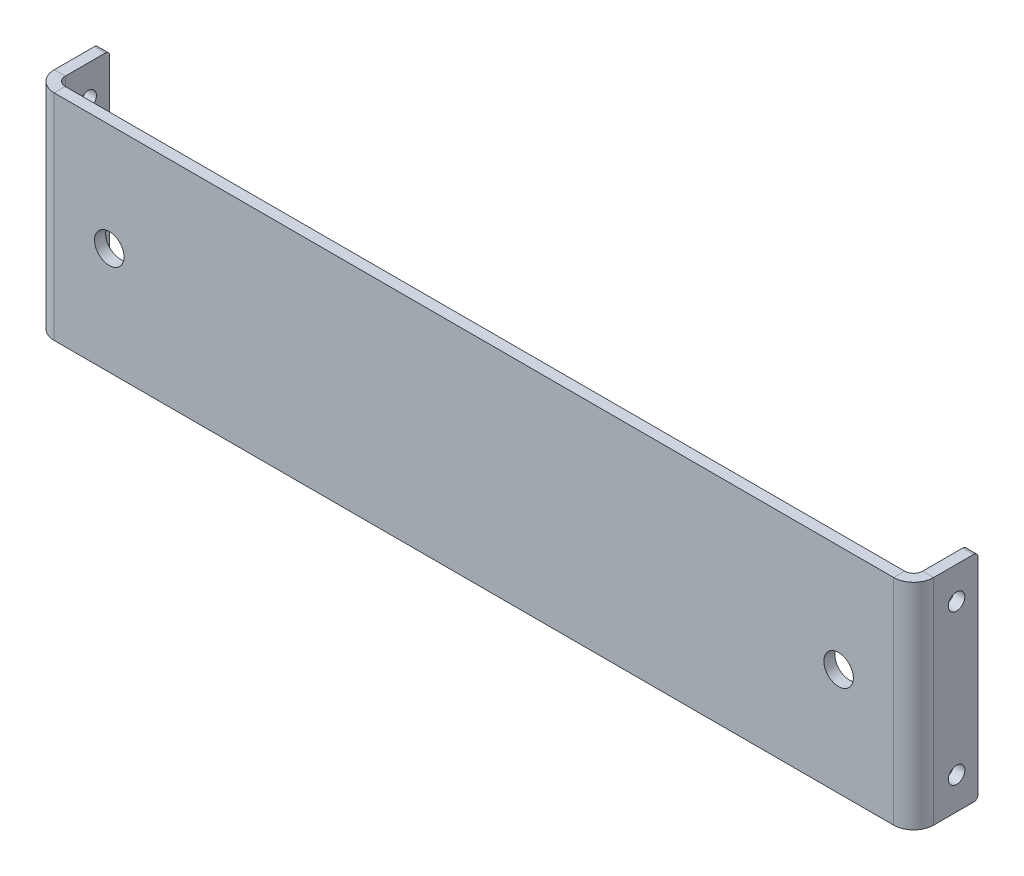
ISO-10303-21;
HEADER;
FILE_DESCRIPTION(('STEP AP214'),'2;1');
FILE_NAME('part.step','',(''),(''),'','','');
FILE_SCHEMA(('AUTOMOTIVE_DESIGN { 1 0 10303 214 1 1 1 1 }'));
ENDSEC;
DATA;
#1=APPLICATION_CONTEXT('core data for automotive mechanical design processes');
#2=APPLICATION_PROTOCOL_DEFINITION('international standard','automotive_design',2000,#1);
#3=PRODUCT_CONTEXT('',#1,'mechanical');
#4=PRODUCT('Part','Part','',(#3));
#5=PRODUCT_RELATED_PRODUCT_CATEGORY('part','',(#4));
#6=PRODUCT_DEFINITION_FORMATION('','',#4);
#7=PRODUCT_DEFINITION_CONTEXT('part definition',#1,'design');
#8=PRODUCT_DEFINITION('design','',#6,#7);
#9=PRODUCT_DEFINITION_SHAPE('','',#8);
#10=(LENGTH_UNIT() NAMED_UNIT(*) SI_UNIT(.MILLI.,.METRE.));
#11=(NAMED_UNIT(*) PLANE_ANGLE_UNIT() SI_UNIT($,.RADIAN.));
#12=(NAMED_UNIT(*) SI_UNIT($,.STERADIAN.) SOLID_ANGLE_UNIT());
#13=UNCERTAINTY_MEASURE_WITH_UNIT(LENGTH_MEASURE(1.E-05),#10,'distance_accuracy_value','');
#14=(GEOMETRIC_REPRESENTATION_CONTEXT(3) GLOBAL_UNCERTAINTY_ASSIGNED_CONTEXT((#13)) GLOBAL_UNIT_ASSIGNED_CONTEXT((#10,
#11,#12)) REPRESENTATION_CONTEXT('',''));
#15=CARTESIAN_POINT('',(0.,0.,0.));
#16=DIRECTION('',(0.,0.,1.));
#17=DIRECTION('',(1.,0.,0.));
#18=AXIS2_PLACEMENT_3D('',#15,#16,#17);
#19=CARTESIAN_POINT('',(0.,0.,-3.2639));
#20=DIRECTION('',(0.,0.,-1.));
#21=DIRECTION('',(-1.,0.,0.));
#22=AXIS2_PLACEMENT_3D('',#19,#20,#21);
#23=PLANE('',#22);
#24=CARTESIAN_POINT('',(-107.95,0.,-3.2639));
#25=DIRECTION('',(0.,0.,-1.));
#26=DIRECTION('',(-1.,0.,0.));
#27=AXIS2_PLACEMENT_3D('',#24,#25,#26);
#28=CIRCLE('',#27,4.365625);
#29=CARTESIAN_POINT('',(-112.315625,0.,-3.2639));
#30=VERTEX_POINT('',#29);
#31=EDGE_CURVE('E446',#30,#30,#28,.T.);
#32=ORIENTED_EDGE('',*,*,#31,.F.);
#33=EDGE_LOOP('',(#32));
#34=FACE_BOUND('',#33,.T.);
#35=CARTESIAN_POINT('',(107.95,0.,-3.2639));
#36=DIRECTION('',(0.,0.,-1.));
#37=DIRECTION('',(-1.,0.,0.));
#38=AXIS2_PLACEMENT_3D('',#35,#36,#37);
#39=CIRCLE('',#38,4.365625);
#40=CARTESIAN_POINT('',(103.584375,0.,-3.2639));
#41=VERTEX_POINT('',#40);
#42=EDGE_CURVE('E440',#41,#41,#39,.T.);
#43=ORIENTED_EDGE('',*,*,#42,.F.);
#44=EDGE_LOOP('',(#43));
#45=FACE_BOUND('',#44,.T.);
#46=DIRECTION('',(1.,0.,0.));
#47=VECTOR('',#46,1.);
#48=CARTESIAN_POINT('',(-130.175,-31.75,-3.2639));
#49=LINE('',#48,#47);
#50=CARTESIAN_POINT('',(-124.25426,-31.75,-3.26390000000002));
#51=VERTEX_POINT('',#50);
#52=CARTESIAN_POINT('',(124.25426,-31.75,-3.2639));
#53=VERTEX_POINT('',#52);
#54=EDGE_CURVE('E314',#51,#53,#49,.T.);
#55=ORIENTED_EDGE('',*,*,#54,.F.);
#56=DIRECTION('',(0.,1.,0.));
#57=VECTOR('',#56,1.);
#58=CARTESIAN_POINT('',(-124.25426,31.75,-3.26390000000002));
#59=LINE('',#58,#57);
#60=CARTESIAN_POINT('',(-124.25426,31.75,-3.26390000000002));
#61=VERTEX_POINT('',#60);
#62=EDGE_CURVE('E252',#61,#51,#59,.F.);
#63=ORIENTED_EDGE('',*,*,#62,.F.);
#64=DIRECTION('',(-1.,0.,0.));
#65=VECTOR('',#64,1.);
#66=CARTESIAN_POINT('',(-130.175,31.75,-3.2639));
#67=LINE('',#66,#65);
#68=CARTESIAN_POINT('',(124.25426,31.75,-3.2639));
#69=VERTEX_POINT('',#68);
#70=EDGE_CURVE('E311',#69,#61,#67,.T.);
#71=ORIENTED_EDGE('',*,*,#70,.F.);
#72=DIRECTION('',(0.,-1.,0.));
#73=VECTOR('',#72,1.);
#74=CARTESIAN_POINT('',(124.25426,-31.75,-3.26390000000002));
#75=LINE('',#74,#73);
#76=EDGE_CURVE('E301',#53,#69,#75,.F.);
#77=ORIENTED_EDGE('',*,*,#76,.F.);
#78=EDGE_LOOP('',(#55,#63,#71,#77));
#79=FACE_BOUND('',#78,.T.);
#80=ADVANCED_FACE('F81',(#34,#45,#79),#23,.T.);
#81=CARTESIAN_POINT('',(0.,0.,0.));
#82=DIRECTION('',(0.,0.,-1.));
#83=DIRECTION('',(-1.,0.,0.));
#84=AXIS2_PLACEMENT_3D('',#81,#82,#83);
#85=PLANE('',#84);
#86=CARTESIAN_POINT('',(-107.95,0.,0.));
#87=DIRECTION('',(0.,0.,1.));
#88=DIRECTION('',(1.,0.,0.));
#89=AXIS2_PLACEMENT_3D('',#86,#87,#88);
#90=CIRCLE('',#89,4.365625);
#91=CARTESIAN_POINT('',(-103.584375,0.,0.));
#92=VERTEX_POINT('',#91);
#93=EDGE_CURVE('E449',#92,#92,#90,.T.);
#94=ORIENTED_EDGE('',*,*,#93,.F.);
#95=EDGE_LOOP('',(#94));
#96=FACE_BOUND('',#95,.T.);
#97=CARTESIAN_POINT('',(107.95,0.,0.));
#98=DIRECTION('',(0.,0.,1.));
#99=DIRECTION('',(1.,0.,0.));
#100=AXIS2_PLACEMENT_3D('',#97,#98,#99);
#101=CIRCLE('',#100,4.365625);
#102=CARTESIAN_POINT('',(112.315625,0.,0.));
#103=VERTEX_POINT('',#102);
#104=EDGE_CURVE('E443',#103,#103,#101,.T.);
#105=ORIENTED_EDGE('',*,*,#104,.F.);
#106=EDGE_LOOP('',(#105));
#107=FACE_BOUND('',#106,.T.);
#108=DIRECTION('',(0.,1.,0.));
#109=VECTOR('',#108,1.);
#110=CARTESIAN_POINT('',(-124.25426,31.75,0.));
#111=LINE('',#110,#109);
#112=CARTESIAN_POINT('',(-124.25426,31.75,0.));
#113=VERTEX_POINT('',#112);
#114=CARTESIAN_POINT('',(-124.25426,-31.75,0.));
#115=VERTEX_POINT('',#114);
#116=EDGE_CURVE('E219',#113,#115,#111,.F.);
#117=ORIENTED_EDGE('',*,*,#116,.T.);
#118=DIRECTION('',(1.,0.,0.));
#119=VECTOR('',#118,1.);
#120=CARTESIAN_POINT('',(-130.175,-31.75,0.));
#121=LINE('',#120,#119);
#122=CARTESIAN_POINT('',(124.25426,-31.75,0.));
#123=VERTEX_POINT('',#122);
#124=EDGE_CURVE('E315',#115,#123,#121,.T.);
#125=ORIENTED_EDGE('',*,*,#124,.T.);
#126=DIRECTION('',(0.,-1.,0.));
#127=VECTOR('',#126,1.);
#128=CARTESIAN_POINT('',(124.25426,-31.75,0.));
#129=LINE('',#128,#127);
#130=CARTESIAN_POINT('',(124.25426,31.75,0.));
#131=VERTEX_POINT('',#130);
#132=EDGE_CURVE('E289',#123,#131,#129,.F.);
#133=ORIENTED_EDGE('',*,*,#132,.T.);
#134=DIRECTION('',(-1.,0.,0.));
#135=VECTOR('',#134,1.);
#136=CARTESIAN_POINT('',(-130.175,31.75,0.));
#137=LINE('',#136,#135);
#138=EDGE_CURVE('E309',#131,#113,#137,.T.);
#139=ORIENTED_EDGE('',*,*,#138,.T.);
#140=EDGE_LOOP('',(#117,#125,#133,#139));
#141=FACE_BOUND('',#140,.T.);
#142=ADVANCED_FACE('F396',(#96,#107,#141),#85,.F.);
#143=CARTESIAN_POINT('',(-130.175,31.75,-3.2639));
#144=DIRECTION('',(0.,1.,0.));
#145=DIRECTION('',(0.,0.,1.));
#146=AXIS2_PLACEMENT_3D('',#143,#144,#145);
#147=PLANE('',#146);
#148=ORIENTED_EDGE('',*,*,#70,.T.);
#149=DIRECTION('',(0.,0.,1.));
#150=VECTOR('',#149,1.);
#151=CARTESIAN_POINT('',(-124.25426,31.75,-3.26390000000002));
#152=LINE('',#151,#150);
#153=EDGE_CURVE('E248',#61,#113,#152,.T.);
#154=ORIENTED_EDGE('',*,*,#153,.T.);
#155=ORIENTED_EDGE('',*,*,#138,.F.);
#156=DIRECTION('',(0.,0.,1.));
#157=VECTOR('',#156,1.);
#158=CARTESIAN_POINT('',(124.25426,31.75,-3.26390000000002));
#159=LINE('',#158,#157);
#160=EDGE_CURVE('E306',#69,#131,#159,.T.);
#161=ORIENTED_EDGE('',*,*,#160,.F.);
#162=EDGE_LOOP('',(#148,#154,#155,#161));
#163=FACE_BOUND('',#162,.T.);
#164=ADVANCED_FACE('F399',(#163),#147,.T.);
#165=CARTESIAN_POINT('',(-130.175,-31.75,-3.2639));
#166=DIRECTION('',(0.,-1.,0.));
#167=DIRECTION('',(0.,0.,-1.));
#168=AXIS2_PLACEMENT_3D('',#165,#166,#167);
#169=PLANE('',#168);
#170=DIRECTION('',(0.,0.,1.));
#171=VECTOR('',#170,1.);
#172=CARTESIAN_POINT('',(-124.25426,-31.75,-3.26390000000002));
#173=LINE('',#172,#171);
#174=EDGE_CURVE('E256',#51,#115,#173,.T.);
#175=ORIENTED_EDGE('',*,*,#174,.F.);
#176=ORIENTED_EDGE('',*,*,#54,.T.);
#177=DIRECTION('',(0.,0.,1.));
#178=VECTOR('',#177,1.);
#179=CARTESIAN_POINT('',(124.25426,-31.75,-3.26390000000002));
#180=LINE('',#179,#178);
#181=EDGE_CURVE('E295',#53,#123,#180,.T.);
#182=ORIENTED_EDGE('',*,*,#181,.T.);
#183=ORIENTED_EDGE('',*,*,#124,.F.);
#184=EDGE_LOOP('',(#175,#176,#182,#183));
#185=FACE_BOUND('',#184,.T.);
#186=ADVANCED_FACE('F394',(#185),#169,.T.);
#187=CARTESIAN_POINT('',(124.25426,31.75,-5.92074000000002));
#188=DIRECTION('',(0.,1.,0.));
#189=DIRECTION('',(0.,0.,1.));
#190=AXIS2_PLACEMENT_3D('',#187,#188,#189);
#191=PLANE('',#190);
#192=DIRECTION('',(1.,0.,0.));
#193=VECTOR('',#192,1.);
#194=CARTESIAN_POINT('',(130.175,31.75,-5.92074));
#195=LINE('',#194,#193);
#196=CARTESIAN_POINT('',(126.9111,31.75,-5.92074000000001));
#197=VERTEX_POINT('',#196);
#198=CARTESIAN_POINT('',(130.175,31.75,-5.92074));
#199=VERTEX_POINT('',#198);
#200=EDGE_CURVE('E259',#197,#199,#195,.T.);
#201=ORIENTED_EDGE('',*,*,#200,.F.);
#202=CARTESIAN_POINT('',(124.25426,31.75,-5.92074000000002));
#203=DIRECTION('',(0.,-1.,0.));
#204=DIRECTION('',(0.,0.,-1.));
#205=AXIS2_PLACEMENT_3D('',#202,#203,#204);
#206=CIRCLE('',#205,2.65683999999999);
#207=EDGE_CURVE('E298',#69,#197,#206,.F.);
#208=ORIENTED_EDGE('',*,*,#207,.F.);
#209=ORIENTED_EDGE('',*,*,#160,.T.);
#210=CARTESIAN_POINT('',(124.25426,31.75,-5.92074000000002));
#211=DIRECTION('',(0.,-1.,0.));
#212=DIRECTION('',(0.,0.,-1.));
#213=AXIS2_PLACEMENT_3D('',#210,#211,#212);
#214=CIRCLE('',#213,5.92073999999999);
#215=EDGE_CURVE('E291',#131,#199,#214,.F.);
#216=ORIENTED_EDGE('',*,*,#215,.T.);
#217=EDGE_LOOP('',(#201,#208,#209,#216));
#218=FACE_BOUND('',#217,.T.);
#219=ADVANCED_FACE('F380',(#218),#191,.T.);
#220=CARTESIAN_POINT('',(124.25426,-31.75,-5.92074000000002));
#221=DIRECTION('',(0.,1.,0.));
#222=DIRECTION('',(0.,0.,1.));
#223=AXIS2_PLACEMENT_3D('',#220,#221,#222);
#224=PLANE('',#223);
#225=CARTESIAN_POINT('',(124.25426,-31.75,-5.92074000000002));
#226=DIRECTION('',(0.,-1.,0.));
#227=DIRECTION('',(0.,0.,-1.));
#228=AXIS2_PLACEMENT_3D('',#225,#226,#227);
#229=CIRCLE('',#228,2.65683999999999);
#230=CARTESIAN_POINT('',(126.9111,-31.75,-5.92074000000001));
#231=VERTEX_POINT('',#230);
#232=EDGE_CURVE('E264',#231,#53,#229,.T.);
#233=ORIENTED_EDGE('',*,*,#232,.F.);
#234=DIRECTION('',(1.,0.,0.));
#235=VECTOR('',#234,1.);
#236=CARTESIAN_POINT('',(126.9111,-31.75,-5.92074000000001));
#237=LINE('',#236,#235);
#238=CARTESIAN_POINT('',(130.175,-31.75,-5.92074));
#239=VERTEX_POINT('',#238);
#240=EDGE_CURVE('E281',#231,#239,#237,.T.);
#241=ORIENTED_EDGE('',*,*,#240,.T.);
#242=CARTESIAN_POINT('',(124.25426,-31.75,-5.92074000000002));
#243=DIRECTION('',(0.,-1.,0.));
#244=DIRECTION('',(0.,0.,-1.));
#245=AXIS2_PLACEMENT_3D('',#242,#243,#244);
#246=CIRCLE('',#245,5.92073999999999);
#247=EDGE_CURVE('E292',#239,#123,#246,.T.);
#248=ORIENTED_EDGE('',*,*,#247,.T.);
#249=ORIENTED_EDGE('',*,*,#181,.F.);
#250=EDGE_LOOP('',(#233,#241,#248,#249));
#251=FACE_BOUND('',#250,.T.);
#252=ADVANCED_FACE('F373',(#251),#224,.F.);
#253=CARTESIAN_POINT('',(124.25426,-31.75,-5.92074000000002));
#254=DIRECTION('',(0.,-1.,0.));
#255=DIRECTION('',(1.,0.,0.));
#256=AXIS2_PLACEMENT_3D('',#253,#254,#255);
#257=CYLINDRICAL_SURFACE('',#256,5.92073999999999);
#258=ORIENTED_EDGE('',*,*,#132,.F.);
#259=ORIENTED_EDGE('',*,*,#247,.F.);
#260=DIRECTION('',(0.,-1.,0.));
#261=VECTOR('',#260,1.);
#262=CARTESIAN_POINT('',(130.175,0.,-5.92074));
#263=LINE('',#262,#261);
#264=EDGE_CURVE('E278',#199,#239,#263,.T.);
#265=ORIENTED_EDGE('',*,*,#264,.F.);
#266=ORIENTED_EDGE('',*,*,#215,.F.);
#267=EDGE_LOOP('',(#258,#259,#265,#266));
#268=FACE_BOUND('',#267,.T.);
#269=ADVANCED_FACE('F378',(#268),#257,.T.);
#270=CARTESIAN_POINT('',(124.25426,-31.75,-5.92074000000002));
#271=DIRECTION('',(0.,-1.,0.));
#272=DIRECTION('',(1.,0.,0.));
#273=AXIS2_PLACEMENT_3D('',#270,#271,#272);
#274=CYLINDRICAL_SURFACE('',#273,2.65683999999999);
#275=ORIENTED_EDGE('',*,*,#76,.T.);
#276=ORIENTED_EDGE('',*,*,#207,.T.);
#277=DIRECTION('',(0.,1.,0.));
#278=VECTOR('',#277,1.);
#279=CARTESIAN_POINT('',(126.9111,31.75,-5.92074000000001));
#280=LINE('',#279,#278);
#281=EDGE_CURVE('E284',#197,#231,#280,.F.);
#282=ORIENTED_EDGE('',*,*,#281,.T.);
#283=ORIENTED_EDGE('',*,*,#232,.T.);
#284=EDGE_LOOP('',(#275,#276,#282,#283));
#285=FACE_BOUND('',#284,.T.);
#286=ADVANCED_FACE('F387',(#285),#274,.F.);
#287=CARTESIAN_POINT('',(130.175,-31.75,-3.26389999999999));
#288=DIRECTION('',(0.,-1.,0.));
#289=DIRECTION('',(0.,0.,-1.));
#290=AXIS2_PLACEMENT_3D('',#287,#288,#289);
#291=PLANE('',#290);
#292=DIRECTION('',(0.,0.,-1.));
#293=VECTOR('',#292,1.);
#294=CARTESIAN_POINT('',(126.9111,-31.75,4.57754867353493E-13));
#295=LINE('',#294,#293);
#296=CARTESIAN_POINT('',(126.9111,-31.75,-17.78));
#297=VERTEX_POINT('',#296);
#298=EDGE_CURVE('E270',#297,#231,#295,.F.);
#299=ORIENTED_EDGE('',*,*,#298,.F.);
#300=DIRECTION('',(-1.,0.,0.));
#301=VECTOR('',#300,1.);
#302=CARTESIAN_POINT('',(130.175,-31.75,-17.78));
#303=LINE('',#302,#301);
#304=CARTESIAN_POINT('',(130.175,-31.75,-17.78));
#305=VERTEX_POINT('',#304);
#306=EDGE_CURVE('E104',#297,#305,#303,.F.);
#307=ORIENTED_EDGE('',*,*,#306,.T.);
#308=DIRECTION('',(0.,0.,1.));
#309=VECTOR('',#308,1.);
#310=CARTESIAN_POINT('',(130.175,-31.75,-3.26389999999999));
#311=LINE('',#310,#309);
#312=EDGE_CURVE('E262',#305,#239,#311,.T.);
#313=ORIENTED_EDGE('',*,*,#312,.T.);
#314=ORIENTED_EDGE('',*,*,#240,.F.);
#315=EDGE_LOOP('',(#299,#307,#313,#314));
#316=FACE_BOUND('',#315,.T.);
#317=ADVANCED_FACE('F369',(#316),#291,.T.);
#318=CARTESIAN_POINT('',(130.175,31.75,-19.05));
#319=DIRECTION('',(0.,1.,0.));
#320=DIRECTION('',(0.,0.,1.));
#321=AXIS2_PLACEMENT_3D('',#318,#319,#320);
#322=PLANE('',#321);
#323=DIRECTION('',(0.,0.,-1.));
#324=VECTOR('',#323,1.);
#325=CARTESIAN_POINT('',(130.175,31.75,-19.05));
#326=LINE('',#325,#324);
#327=CARTESIAN_POINT('',(130.175,31.75,-17.78));
#328=VERTEX_POINT('',#327);
#329=EDGE_CURVE('E268',#199,#328,#326,.T.);
#330=ORIENTED_EDGE('',*,*,#329,.T.);
#331=DIRECTION('',(-1.,0.,0.));
#332=VECTOR('',#331,1.);
#333=CARTESIAN_POINT('',(130.175,31.75,-17.78));
#334=LINE('',#333,#332);
#335=CARTESIAN_POINT('',(126.9111,31.75,-17.78));
#336=VERTEX_POINT('',#335);
#337=EDGE_CURVE('E13',#328,#336,#334,.T.);
#338=ORIENTED_EDGE('',*,*,#337,.T.);
#339=DIRECTION('',(0.,0.,1.));
#340=VECTOR('',#339,1.);
#341=CARTESIAN_POINT('',(126.9111,31.75,4.43798926275643E-13));
#342=LINE('',#341,#340);
#343=EDGE_CURVE('E275',#197,#336,#342,.F.);
#344=ORIENTED_EDGE('',*,*,#343,.F.);
#345=ORIENTED_EDGE('',*,*,#200,.T.);
#346=EDGE_LOOP('',(#330,#338,#344,#345));
#347=FACE_BOUND('',#346,.T.);
#348=ADVANCED_FACE('F384',(#347),#322,.T.);
#349=CARTESIAN_POINT('',(130.175,0.,4.69150713295343E-13));
#350=DIRECTION('',(1.,0.,0.));
#351=DIRECTION('',(0.,0.,-1.));
#352=AXIS2_PLACEMENT_3D('',#349,#350,#351);
#353=PLANE('',#352);
#354=CARTESIAN_POINT('',(130.175,22.225,-12.7));
#355=DIRECTION('',(1.,0.,0.));
#356=DIRECTION('',(0.,0.,-1.));
#357=AXIS2_PLACEMENT_3D('',#354,#355,#356);
#358=CIRCLE('',#357,2.45745);
#359=CARTESIAN_POINT('',(130.175,22.225,-15.15745));
#360=VERTEX_POINT('',#359);
#361=EDGE_CURVE('E437',#360,#360,#358,.T.);
#362=ORIENTED_EDGE('',*,*,#361,.F.);
#363=EDGE_LOOP('',(#362));
#364=FACE_BOUND('',#363,.T.);
#365=CARTESIAN_POINT('',(130.175,-22.225,-12.7));
#366=DIRECTION('',(1.,0.,0.));
#367=DIRECTION('',(0.,0.,-1.));
#368=AXIS2_PLACEMENT_3D('',#365,#366,#367);
#369=CIRCLE('',#368,2.45745);
#370=CARTESIAN_POINT('',(130.175,-22.225,-15.15745));
#371=VERTEX_POINT('',#370);
#372=EDGE_CURVE('E430',#371,#371,#369,.T.);
#373=ORIENTED_EDGE('',*,*,#372,.F.);
#374=EDGE_LOOP('',(#373));
#375=FACE_BOUND('',#374,.T.);
#376=ORIENTED_EDGE('',*,*,#312,.F.);
#377=CARTESIAN_POINT('',(130.175,-30.48,-17.78));
#378=DIRECTION('',(1.,0.,0.));
#379=DIRECTION('',(0.,0.,-1.));
#380=AXIS2_PLACEMENT_3D('',#377,#378,#379);
#381=CIRCLE('',#380,1.27);
#382=CARTESIAN_POINT('',(130.175,-30.48,-19.05));
#383=VERTEX_POINT('',#382);
#384=EDGE_CURVE('E89',#305,#383,#381,.T.);
#385=ORIENTED_EDGE('',*,*,#384,.T.);
#386=DIRECTION('',(0.,-1.,0.));
#387=VECTOR('',#386,1.);
#388=CARTESIAN_POINT('',(130.175,-31.75,-19.05));
#389=LINE('',#388,#387);
#390=CARTESIAN_POINT('',(130.175,30.48,-19.05));
#391=VERTEX_POINT('',#390);
#392=EDGE_CURVE('E265',#391,#383,#389,.T.);
#393=ORIENTED_EDGE('',*,*,#392,.F.);
#394=CARTESIAN_POINT('',(130.175,30.48,-17.78));
#395=DIRECTION('',(1.,0.,0.));
#396=DIRECTION('',(0.,0.,-1.));
#397=AXIS2_PLACEMENT_3D('',#394,#395,#396);
#398=CIRCLE('',#397,1.27);
#399=EDGE_CURVE('E96',#391,#328,#398,.T.);
#400=ORIENTED_EDGE('',*,*,#399,.T.);
#401=ORIENTED_EDGE('',*,*,#329,.F.);
#402=ORIENTED_EDGE('',*,*,#264,.T.);
#403=EDGE_LOOP('',(#376,#385,#393,#400,#401,#402));
#404=FACE_BOUND('',#403,.T.);
#405=ADVANCED_FACE('F357',(#364,#375,#404),#353,.T.);
#406=CARTESIAN_POINT('',(126.9111,0.,4.57754867353493E-13));
#407=DIRECTION('',(1.,0.,0.));
#408=DIRECTION('',(0.,0.,-1.));
#409=AXIS2_PLACEMENT_3D('',#406,#407,#408);
#410=PLANE('',#409);
#411=CARTESIAN_POINT('',(126.9111,22.225,-12.7));
#412=DIRECTION('',(1.,0.,0.));
#413=DIRECTION('',(0.,0.,-1.));
#414=AXIS2_PLACEMENT_3D('',#411,#412,#413);
#415=CIRCLE('',#414,2.45744999999998);
#416=CARTESIAN_POINT('',(126.9111,22.225,-15.15745));
#417=VERTEX_POINT('',#416);
#418=EDGE_CURVE('E328',#417,#417,#415,.T.);
#419=ORIENTED_EDGE('',*,*,#418,.T.);
#420=EDGE_LOOP('',(#419));
#421=FACE_BOUND('',#420,.T.);
#422=CARTESIAN_POINT('',(126.9111,-22.225,-12.7));
#423=DIRECTION('',(1.,0.,0.));
#424=DIRECTION('',(0.,0.,-1.));
#425=AXIS2_PLACEMENT_3D('',#422,#423,#424);
#426=CIRCLE('',#425,2.45744999999998);
#427=CARTESIAN_POINT('',(126.9111,-22.225,-15.15745));
#428=VERTEX_POINT('',#427);
#429=EDGE_CURVE('E245',#428,#428,#426,.T.);
#430=ORIENTED_EDGE('',*,*,#429,.T.);
#431=EDGE_LOOP('',(#430));
#432=FACE_BOUND('',#431,.T.);
#433=DIRECTION('',(0.,1.,0.));
#434=VECTOR('',#433,1.);
#435=CARTESIAN_POINT('',(126.9111,0.,-19.05));
#436=LINE('',#435,#434);
#437=CARTESIAN_POINT('',(126.9111,30.48,-19.05));
#438=VERTEX_POINT('',#437);
#439=CARTESIAN_POINT('',(126.9111,-30.48,-19.05));
#440=VERTEX_POINT('',#439);
#441=EDGE_CURVE('E272',#438,#440,#436,.F.);
#442=ORIENTED_EDGE('',*,*,#441,.T.);
#443=CARTESIAN_POINT('',(126.9111,-30.48,-17.78));
#444=DIRECTION('',(1.,0.,0.));
#445=DIRECTION('',(0.,0.,-1.));
#446=AXIS2_PLACEMENT_3D('',#443,#444,#445);
#447=CIRCLE('',#446,1.27);
#448=EDGE_CURVE('E353',#440,#297,#447,.F.);
#449=ORIENTED_EDGE('',*,*,#448,.T.);
#450=ORIENTED_EDGE('',*,*,#298,.T.);
#451=ORIENTED_EDGE('',*,*,#281,.F.);
#452=ORIENTED_EDGE('',*,*,#343,.T.);
#453=CARTESIAN_POINT('',(126.9111,30.48,-17.78));
#454=DIRECTION('',(1.,0.,0.));
#455=DIRECTION('',(0.,0.,-1.));
#456=AXIS2_PLACEMENT_3D('',#453,#454,#455);
#457=CIRCLE('',#456,1.27);
#458=EDGE_CURVE('E351',#336,#438,#457,.F.);
#459=ORIENTED_EDGE('',*,*,#458,.T.);
#460=EDGE_LOOP('',(#442,#449,#450,#451,#452,#459));
#461=FACE_BOUND('',#460,.T.);
#462=ADVANCED_FACE('F366',(#421,#432,#461),#410,.F.);
#463=CARTESIAN_POINT('',(130.175,-31.75,-19.05));
#464=DIRECTION('',(0.,0.,-1.));
#465=DIRECTION('',(-1.,0.,0.));
#466=AXIS2_PLACEMENT_3D('',#463,#464,#465);
#467=PLANE('',#466);
#468=ORIENTED_EDGE('',*,*,#392,.T.);
#469=DIRECTION('',(-1.,0.,0.));
#470=VECTOR('',#469,1.);
#471=CARTESIAN_POINT('',(130.175,-30.48,-19.05));
#472=LINE('',#471,#470);
#473=EDGE_CURVE('E348',#383,#440,#472,.T.);
#474=ORIENTED_EDGE('',*,*,#473,.T.);
#475=ORIENTED_EDGE('',*,*,#441,.F.);
#476=DIRECTION('',(-1.,0.,0.));
#477=VECTOR('',#476,1.);
#478=CARTESIAN_POINT('',(130.175,30.48,-19.05));
#479=LINE('',#478,#477);
#480=EDGE_CURVE('E346',#438,#391,#479,.F.);
#481=ORIENTED_EDGE('',*,*,#480,.T.);
#482=EDGE_LOOP('',(#468,#474,#475,#481));
#483=FACE_BOUND('',#482,.T.);
#484=ADVANCED_FACE('F361',(#483),#467,.T.);
#485=CARTESIAN_POINT('',(-124.25426,-31.75,-5.92074000000002));
#486=DIRECTION('',(0.,-1.,0.));
#487=DIRECTION('',(0.,0.,-1.));
#488=AXIS2_PLACEMENT_3D('',#485,#486,#487);
#489=PLANE('',#488);
#490=DIRECTION('',(-1.,0.,0.));
#491=VECTOR('',#490,1.);
#492=CARTESIAN_POINT('',(-130.175,-31.75,-5.92074));
#493=LINE('',#492,#491);
#494=CARTESIAN_POINT('',(-126.9111,-31.75,-5.92074000000001));
#495=VERTEX_POINT('',#494);
#496=CARTESIAN_POINT('',(-130.175,-31.75,-5.92074));
#497=VERTEX_POINT('',#496);
#498=EDGE_CURVE('E242',#495,#497,#493,.T.);
#499=ORIENTED_EDGE('',*,*,#498,.F.);
#500=CARTESIAN_POINT('',(-124.25426,-31.75,-5.92074000000002));
#501=DIRECTION('',(0.,1.,0.));
#502=DIRECTION('',(0.,0.,1.));
#503=AXIS2_PLACEMENT_3D('',#500,#501,#502);
#504=CIRCLE('',#503,2.65683999999999);
#505=EDGE_CURVE('E222',#51,#495,#504,.F.);
#506=ORIENTED_EDGE('',*,*,#505,.F.);
#507=ORIENTED_EDGE('',*,*,#174,.T.);
#508=CARTESIAN_POINT('',(-124.25426,-31.75,-5.92074000000002));
#509=DIRECTION('',(0.,1.,0.));
#510=DIRECTION('',(0.,0.,1.));
#511=AXIS2_PLACEMENT_3D('',#508,#509,#510);
#512=CIRCLE('',#511,5.92073999999999);
#513=EDGE_CURVE('E247',#115,#497,#512,.F.);
#514=ORIENTED_EDGE('',*,*,#513,.T.);
#515=EDGE_LOOP('',(#499,#506,#507,#514));
#516=FACE_BOUND('',#515,.T.);
#517=ADVANCED_FACE('F560',(#516),#489,.T.);
#518=CARTESIAN_POINT('',(-124.25426,31.75,-5.92074000000002));
#519=DIRECTION('',(0.,-1.,0.));
#520=DIRECTION('',(0.,0.,-1.));
#521=AXIS2_PLACEMENT_3D('',#518,#519,#520);
#522=PLANE('',#521);
#523=CARTESIAN_POINT('',(-124.25426,31.75,-5.92074000000002));
#524=DIRECTION('',(0.,1.,0.));
#525=DIRECTION('',(0.,0.,1.));
#526=AXIS2_PLACEMENT_3D('',#523,#524,#525);
#527=CIRCLE('',#526,2.65683999999999);
#528=CARTESIAN_POINT('',(-126.9111,31.75,-5.92074000000001));
#529=VERTEX_POINT('',#528);
#530=EDGE_CURVE('E208',#529,#61,#527,.T.);
#531=ORIENTED_EDGE('',*,*,#530,.F.);
#532=DIRECTION('',(-1.,0.,0.));
#533=VECTOR('',#532,1.);
#534=CARTESIAN_POINT('',(-126.9111,31.75,-5.92074000000001));
#535=LINE('',#534,#533);
#536=CARTESIAN_POINT('',(-130.175,31.75,-5.92074));
#537=VERTEX_POINT('',#536);
#538=EDGE_CURVE('E202',#529,#537,#535,.T.);
#539=ORIENTED_EDGE('',*,*,#538,.T.);
#540=CARTESIAN_POINT('',(-124.25426,31.75,-5.92074000000002));
#541=DIRECTION('',(0.,1.,0.));
#542=DIRECTION('',(0.,0.,1.));
#543=AXIS2_PLACEMENT_3D('',#540,#541,#542);
#544=CIRCLE('',#543,5.92073999999999);
#545=EDGE_CURVE('E214',#537,#113,#544,.T.);
#546=ORIENTED_EDGE('',*,*,#545,.T.);
#547=ORIENTED_EDGE('',*,*,#153,.F.);
#548=EDGE_LOOP('',(#531,#539,#546,#547));
#549=FACE_BOUND('',#548,.T.);
#550=ADVANCED_FACE('F225',(#549),#522,.F.);
#551=CARTESIAN_POINT('',(-124.25426,31.75,-5.92074000000002));
#552=DIRECTION('',(0.,1.,0.));
#553=DIRECTION('',(-1.,0.,0.));
#554=AXIS2_PLACEMENT_3D('',#551,#552,#553);
#555=CYLINDRICAL_SURFACE('',#554,5.92073999999999);
#556=ORIENTED_EDGE('',*,*,#116,.F.);
#557=ORIENTED_EDGE('',*,*,#545,.F.);
#558=DIRECTION('',(0.,1.,0.));
#559=VECTOR('',#558,1.);
#560=CARTESIAN_POINT('',(-130.175,-31.75,-5.92074));
#561=LINE('',#560,#559);
#562=EDGE_CURVE('E217',#537,#497,#561,.F.);
#563=ORIENTED_EDGE('',*,*,#562,.T.);
#564=ORIENTED_EDGE('',*,*,#513,.F.);
#565=EDGE_LOOP('',(#556,#557,#563,#564));
#566=FACE_BOUND('',#565,.T.);
#567=ADVANCED_FACE('F215',(#566),#555,.T.);
#568=CARTESIAN_POINT('',(-124.25426,31.75,-5.92074000000002));
#569=DIRECTION('',(0.,1.,0.));
#570=DIRECTION('',(-1.,0.,0.));
#571=AXIS2_PLACEMENT_3D('',#568,#569,#570);
#572=CYLINDRICAL_SURFACE('',#571,2.65683999999999);
#573=ORIENTED_EDGE('',*,*,#62,.T.);
#574=ORIENTED_EDGE('',*,*,#505,.T.);
#575=DIRECTION('',(0.,1.,0.));
#576=VECTOR('',#575,1.);
#577=CARTESIAN_POINT('',(-126.9111,-31.75,-5.92074000000001));
#578=LINE('',#577,#576);
#579=EDGE_CURVE('E227',#495,#529,#578,.T.);
#580=ORIENTED_EDGE('',*,*,#579,.T.);
#581=ORIENTED_EDGE('',*,*,#530,.T.);
#582=EDGE_LOOP('',(#573,#574,#580,#581));
#583=FACE_BOUND('',#582,.T.);
#584=ADVANCED_FACE('F401',(#583),#572,.F.);
#585=CARTESIAN_POINT('',(-130.175,-31.75,-3.26389999999999));
#586=DIRECTION('',(0.,-1.,0.));
#587=DIRECTION('',(0.,0.,-1.));
#588=AXIS2_PLACEMENT_3D('',#585,#586,#587);
#589=PLANE('',#588);
#590=DIRECTION('',(0.,0.,1.));
#591=VECTOR('',#590,1.);
#592=CARTESIAN_POINT('',(-130.175,-31.75,-3.26389999999999));
#593=LINE('',#592,#591);
#594=CARTESIAN_POINT('',(-130.175,-31.75,-17.78));
#595=VERTEX_POINT('',#594);
#596=EDGE_CURVE('E232',#497,#595,#593,.F.);
#597=ORIENTED_EDGE('',*,*,#596,.T.);
#598=DIRECTION('',(1.,0.,0.));
#599=VECTOR('',#598,1.);
#600=CARTESIAN_POINT('',(-130.175,-31.75,-17.78));
#601=LINE('',#600,#599);
#602=CARTESIAN_POINT('',(-126.9111,-31.75,-17.78));
#603=VERTEX_POINT('',#602);
#604=EDGE_CURVE('E343',#595,#603,#601,.T.);
#605=ORIENTED_EDGE('',*,*,#604,.T.);
#606=DIRECTION('',(0.,0.,-1.));
#607=VECTOR('',#606,1.);
#608=CARTESIAN_POINT('',(-126.9111,-31.75,4.57754867353493E-13));
#609=LINE('',#608,#607);
#610=EDGE_CURVE('E233',#495,#603,#609,.T.);
#611=ORIENTED_EDGE('',*,*,#610,.F.);
#612=ORIENTED_EDGE('',*,*,#498,.T.);
#613=EDGE_LOOP('',(#597,#605,#611,#612));
#614=FACE_BOUND('',#613,.T.);
#615=ADVANCED_FACE('F410',(#614),#589,.T.);
#616=CARTESIAN_POINT('',(-130.175,31.75,-19.05));
#617=DIRECTION('',(0.,1.,0.));
#618=DIRECTION('',(0.,0.,1.));
#619=AXIS2_PLACEMENT_3D('',#616,#617,#618);
#620=PLANE('',#619);
#621=DIRECTION('',(0.,0.,1.));
#622=VECTOR('',#621,1.);
#623=CARTESIAN_POINT('',(-126.9111,31.75,4.43798926275643E-13));
#624=LINE('',#623,#622);
#625=CARTESIAN_POINT('',(-126.9111,31.75,-17.78));
#626=VERTEX_POINT('',#625);
#627=EDGE_CURVE('E408',#626,#529,#624,.T.);
#628=ORIENTED_EDGE('',*,*,#627,.F.);
#629=DIRECTION('',(1.,0.,0.));
#630=VECTOR('',#629,1.);
#631=CARTESIAN_POINT('',(-130.175,31.75,-17.78));
#632=LINE('',#631,#630);
#633=CARTESIAN_POINT('',(-130.175,31.75,-17.78));
#634=VERTEX_POINT('',#633);
#635=EDGE_CURVE('E204',#626,#634,#632,.F.);
#636=ORIENTED_EDGE('',*,*,#635,.T.);
#637=DIRECTION('',(0.,0.,-1.));
#638=VECTOR('',#637,1.);
#639=CARTESIAN_POINT('',(-130.175,31.75,-19.05));
#640=LINE('',#639,#638);
#641=EDGE_CURVE('E197',#634,#537,#640,.F.);
#642=ORIENTED_EDGE('',*,*,#641,.T.);
#643=ORIENTED_EDGE('',*,*,#538,.F.);
#644=EDGE_LOOP('',(#628,#636,#642,#643));
#645=FACE_BOUND('',#644,.T.);
#646=ADVANCED_FACE('F200',(#645),#620,.T.);
#647=CARTESIAN_POINT('',(-130.175,0.,4.69150713295344E-13));
#648=DIRECTION('',(1.,0.,0.));
#649=DIRECTION('',(0.,0.,-1.));
#650=AXIS2_PLACEMENT_3D('',#647,#648,#649);
#651=PLANE('',#650);
#652=CARTESIAN_POINT('',(-130.175,22.225,-12.7000000000009));
#653=DIRECTION('',(1.,0.,0.));
#654=DIRECTION('',(0.,0.,-1.));
#655=AXIS2_PLACEMENT_3D('',#652,#653,#654);
#656=CIRCLE('',#655,2.45744999999997);
#657=CARTESIAN_POINT('',(-130.175,22.225,-15.1574500000009));
#658=VERTEX_POINT('',#657);
#659=EDGE_CURVE('E329',#658,#658,#656,.T.);
#660=ORIENTED_EDGE('',*,*,#659,.T.);
#661=EDGE_LOOP('',(#660));
#662=FACE_BOUND('',#661,.T.);
#663=CARTESIAN_POINT('',(-130.175,-22.225,-12.7000000000009));
#664=DIRECTION('',(1.,0.,0.));
#665=DIRECTION('',(0.,0.,-1.));
#666=AXIS2_PLACEMENT_3D('',#663,#664,#665);
#667=CIRCLE('',#666,2.45744999999997);
#668=CARTESIAN_POINT('',(-130.175,-22.225,-15.1574500000009));
#669=VERTEX_POINT('',#668);
#670=EDGE_CURVE('E324',#669,#669,#667,.T.);
#671=ORIENTED_EDGE('',*,*,#670,.T.);
#672=EDGE_LOOP('',(#671));
#673=FACE_BOUND('',#672,.T.);
#674=ORIENTED_EDGE('',*,*,#641,.F.);
#675=CARTESIAN_POINT('',(-130.175,30.48,-17.78));
#676=DIRECTION('',(1.,0.,0.));
#677=DIRECTION('',(0.,0.,-1.));
#678=AXIS2_PLACEMENT_3D('',#675,#676,#677);
#679=CIRCLE('',#678,1.27);
#680=CARTESIAN_POINT('',(-130.175,30.48,-19.05));
#681=VERTEX_POINT('',#680);
#682=EDGE_CURVE('E341',#634,#681,#679,.F.);
#683=ORIENTED_EDGE('',*,*,#682,.T.);
#684=DIRECTION('',(0.,-1.,0.));
#685=VECTOR('',#684,1.);
#686=CARTESIAN_POINT('',(-130.175,-31.75,-19.05));
#687=LINE('',#686,#685);
#688=CARTESIAN_POINT('',(-130.175,-30.48,-19.05));
#689=VERTEX_POINT('',#688);
#690=EDGE_CURVE('E209',#689,#681,#687,.F.);
#691=ORIENTED_EDGE('',*,*,#690,.F.);
#692=CARTESIAN_POINT('',(-130.175,-30.48,-17.78));
#693=DIRECTION('',(1.,0.,0.));
#694=DIRECTION('',(0.,0.,-1.));
#695=AXIS2_PLACEMENT_3D('',#692,#693,#694);
#696=CIRCLE('',#695,1.27);
#697=EDGE_CURVE('E339',#689,#595,#696,.F.);
#698=ORIENTED_EDGE('',*,*,#697,.T.);
#699=ORIENTED_EDGE('',*,*,#596,.F.);
#700=ORIENTED_EDGE('',*,*,#562,.F.);
#701=EDGE_LOOP('',(#674,#683,#691,#698,#699,#700));
#702=FACE_BOUND('',#701,.T.);
#703=ADVANCED_FACE('F230',(#662,#673,#702),#651,.F.);
#704=CARTESIAN_POINT('',(-126.9111,0.,4.57754867353493E-13));
#705=DIRECTION('',(1.,0.,0.));
#706=DIRECTION('',(0.,0.,-1.));
#707=AXIS2_PLACEMENT_3D('',#704,#705,#706);
#708=PLANE('',#707);
#709=CARTESIAN_POINT('',(-126.9111,22.225,-12.7000000000009));
#710=DIRECTION('',(1.,0.,0.));
#711=DIRECTION('',(0.,0.,-1.));
#712=AXIS2_PLACEMENT_3D('',#709,#710,#711);
#713=CIRCLE('',#712,2.45744999999998);
#714=CARTESIAN_POINT('',(-126.9111,22.225,-15.1574500000009));
#715=VERTEX_POINT('',#714);
#716=EDGE_CURVE('E325',#715,#715,#713,.T.);
#717=ORIENTED_EDGE('',*,*,#716,.F.);
#718=EDGE_LOOP('',(#717));
#719=FACE_BOUND('',#718,.T.);
#720=CARTESIAN_POINT('',(-126.9111,-22.225,-12.7000000000009));
#721=DIRECTION('',(1.,0.,0.));
#722=DIRECTION('',(0.,0.,-1.));
#723=AXIS2_PLACEMENT_3D('',#720,#721,#722);
#724=CIRCLE('',#723,2.45744999999998);
#725=CARTESIAN_POINT('',(-126.9111,-22.225,-15.1574500000009));
#726=VERTEX_POINT('',#725);
#727=EDGE_CURVE('E321',#726,#726,#724,.T.);
#728=ORIENTED_EDGE('',*,*,#727,.F.);
#729=EDGE_LOOP('',(#728));
#730=FACE_BOUND('',#729,.T.);
#731=DIRECTION('',(0.,1.,0.));
#732=VECTOR('',#731,1.);
#733=CARTESIAN_POINT('',(-126.9111,0.,-19.05));
#734=LINE('',#733,#732);
#735=CARTESIAN_POINT('',(-126.9111,-30.48,-19.05));
#736=VERTEX_POINT('',#735);
#737=CARTESIAN_POINT('',(-126.9111,30.48,-19.05));
#738=VERTEX_POINT('',#737);
#739=EDGE_CURVE('E236',#736,#738,#734,.T.);
#740=ORIENTED_EDGE('',*,*,#739,.T.);
#741=CARTESIAN_POINT('',(-126.9111,30.48,-17.78));
#742=DIRECTION('',(1.,0.,0.));
#743=DIRECTION('',(0.,0.,-1.));
#744=AXIS2_PLACEMENT_3D('',#741,#742,#743);
#745=CIRCLE('',#744,1.27);
#746=EDGE_CURVE('E336',#738,#626,#745,.T.);
#747=ORIENTED_EDGE('',*,*,#746,.T.);
#748=ORIENTED_EDGE('',*,*,#627,.T.);
#749=ORIENTED_EDGE('',*,*,#579,.F.);
#750=ORIENTED_EDGE('',*,*,#610,.T.);
#751=CARTESIAN_POINT('',(-126.9111,-30.48,-17.78));
#752=DIRECTION('',(1.,0.,0.));
#753=DIRECTION('',(0.,0.,-1.));
#754=AXIS2_PLACEMENT_3D('',#751,#752,#753);
#755=CIRCLE('',#754,1.27);
#756=EDGE_CURVE('E334',#603,#736,#755,.T.);
#757=ORIENTED_EDGE('',*,*,#756,.T.);
#758=EDGE_LOOP('',(#740,#747,#748,#749,#750,#757));
#759=FACE_BOUND('',#758,.T.);
#760=ADVANCED_FACE('F407',(#719,#730,#759),#708,.T.);
#761=CARTESIAN_POINT('',(-130.175,-31.75,-19.05));
#762=DIRECTION('',(0.,0.,-1.));
#763=DIRECTION('',(-1.,0.,0.));
#764=AXIS2_PLACEMENT_3D('',#761,#762,#763);
#765=PLANE('',#764);
#766=ORIENTED_EDGE('',*,*,#690,.T.);
#767=DIRECTION('',(1.,0.,0.));
#768=VECTOR('',#767,1.);
#769=CARTESIAN_POINT('',(-130.175,30.48,-19.05));
#770=LINE('',#769,#768);
#771=EDGE_CURVE('E331',#681,#738,#770,.T.);
#772=ORIENTED_EDGE('',*,*,#771,.T.);
#773=ORIENTED_EDGE('',*,*,#739,.F.);
#774=DIRECTION('',(1.,0.,0.));
#775=VECTOR('',#774,1.);
#776=CARTESIAN_POINT('',(-130.175,-30.48,-19.05));
#777=LINE('',#776,#775);
#778=EDGE_CURVE('E317',#736,#689,#777,.F.);
#779=ORIENTED_EDGE('',*,*,#778,.T.);
#780=EDGE_LOOP('',(#766,#772,#773,#779));
#781=FACE_BOUND('',#780,.T.);
#782=ADVANCED_FACE('F419',(#781),#765,.T.);
#783=CARTESIAN_POINT('',(130.175,-22.225,-12.7));
#784=DIRECTION('',(1.,0.,0.));
#785=DIRECTION('',(0.,0.,-1.));
#786=AXIS2_PLACEMENT_3D('',#783,#784,#785);
#787=CYLINDRICAL_SURFACE('',#786,2.45744999999998);
#788=ORIENTED_EDGE('',*,*,#727,.T.);
#789=EDGE_LOOP('',(#788));
#790=FACE_BOUND('',#789,.T.);
#791=ORIENTED_EDGE('',*,*,#670,.F.);
#792=EDGE_LOOP('',(#791));
#793=FACE_BOUND('',#792,.T.);
#794=ADVANCED_FACE('F520',(#790,#793),#787,.F.);
#795=ORIENTED_EDGE('',*,*,#372,.T.);
#796=EDGE_LOOP('',(#795));
#797=FACE_BOUND('',#796,.T.);
#798=ORIENTED_EDGE('',*,*,#429,.F.);
#799=EDGE_LOOP('',(#798));
#800=FACE_BOUND('',#799,.T.);
#801=ADVANCED_FACE('F606',(#797,#800),#787,.F.);
#802=CARTESIAN_POINT('',(130.175,22.225,-12.7));
#803=DIRECTION('',(1.,0.,0.));
#804=DIRECTION('',(0.,0.,-1.));
#805=AXIS2_PLACEMENT_3D('',#802,#803,#804);
#806=CYLINDRICAL_SURFACE('',#805,2.45744999999998);
#807=ORIENTED_EDGE('',*,*,#716,.T.);
#808=EDGE_LOOP('',(#807));
#809=FACE_BOUND('',#808,.T.);
#810=ORIENTED_EDGE('',*,*,#659,.F.);
#811=EDGE_LOOP('',(#810));
#812=FACE_BOUND('',#811,.T.);
#813=ADVANCED_FACE('F599',(#809,#812),#806,.F.);
#814=ORIENTED_EDGE('',*,*,#361,.T.);
#815=EDGE_LOOP('',(#814));
#816=FACE_BOUND('',#815,.T.);
#817=ORIENTED_EDGE('',*,*,#418,.F.);
#818=EDGE_LOOP('',(#817));
#819=FACE_BOUND('',#818,.T.);
#820=ADVANCED_FACE('F489',(#816,#819),#806,.F.);
#821=CARTESIAN_POINT('',(-130.175,30.48,-17.78));
#822=DIRECTION('',(1.,0.,0.));
#823=DIRECTION('',(0.,0.,-1.));
#824=AXIS2_PLACEMENT_3D('',#821,#822,#823);
#825=CYLINDRICAL_SURFACE('',#824,1.27);
#826=ORIENTED_EDGE('',*,*,#682,.F.);
#827=ORIENTED_EDGE('',*,*,#635,.F.);
#828=ORIENTED_EDGE('',*,*,#746,.F.);
#829=ORIENTED_EDGE('',*,*,#771,.F.);
#830=EDGE_LOOP('',(#826,#827,#828,#829));
#831=FACE_BOUND('',#830,.T.);
#832=ADVANCED_FACE('F486',(#831),#825,.T.);
#833=CARTESIAN_POINT('',(-130.175,-30.48,-17.78));
#834=DIRECTION('',(1.,0.,0.));
#835=DIRECTION('',(0.,0.,-1.));
#836=AXIS2_PLACEMENT_3D('',#833,#834,#835);
#837=CYLINDRICAL_SURFACE('',#836,1.27);
#838=ORIENTED_EDGE('',*,*,#697,.F.);
#839=ORIENTED_EDGE('',*,*,#778,.F.);
#840=ORIENTED_EDGE('',*,*,#756,.F.);
#841=ORIENTED_EDGE('',*,*,#604,.F.);
#842=EDGE_LOOP('',(#838,#839,#840,#841));
#843=FACE_BOUND('',#842,.T.);
#844=ADVANCED_FACE('F414',(#843),#837,.T.);
#845=CARTESIAN_POINT('',(130.175,-30.48,-17.78));
#846=DIRECTION('',(-1.,0.,0.));
#847=DIRECTION('',(0.,0.,1.));
#848=AXIS2_PLACEMENT_3D('',#845,#846,#847);
#849=CYLINDRICAL_SURFACE('',#848,1.27);
#850=ORIENTED_EDGE('',*,*,#384,.F.);
#851=ORIENTED_EDGE('',*,*,#306,.F.);
#852=ORIENTED_EDGE('',*,*,#448,.F.);
#853=ORIENTED_EDGE('',*,*,#473,.F.);
#854=EDGE_LOOP('',(#850,#851,#852,#853));
#855=FACE_BOUND('',#854,.T.);
#856=ADVANCED_FACE('F364',(#855),#849,.T.);
#857=CARTESIAN_POINT('',(130.175,30.48,-17.78));
#858=DIRECTION('',(-1.,0.,0.));
#859=DIRECTION('',(0.,0.,1.));
#860=AXIS2_PLACEMENT_3D('',#857,#858,#859);
#861=CYLINDRICAL_SURFACE('',#860,1.27);
#862=ORIENTED_EDGE('',*,*,#399,.F.);
#863=ORIENTED_EDGE('',*,*,#480,.F.);
#864=ORIENTED_EDGE('',*,*,#458,.F.);
#865=ORIENTED_EDGE('',*,*,#337,.F.);
#866=EDGE_LOOP('',(#862,#863,#864,#865));
#867=FACE_BOUND('',#866,.T.);
#868=ADVANCED_FACE('F83',(#867),#861,.T.);
#869=CARTESIAN_POINT('',(107.95,0.,0.));
#870=DIRECTION('',(0.,0.,1.));
#871=DIRECTION('',(1.,0.,0.));
#872=AXIS2_PLACEMENT_3D('',#869,#870,#871);
#873=CYLINDRICAL_SURFACE('',#872,4.365625);
#874=ORIENTED_EDGE('',*,*,#42,.T.);
#875=EDGE_LOOP('',(#874));
#876=FACE_BOUND('',#875,.T.);
#877=ORIENTED_EDGE('',*,*,#104,.T.);
#878=EDGE_LOOP('',(#877));
#879=FACE_BOUND('',#878,.T.);
#880=ADVANCED_FACE('F460',(#876,#879),#873,.F.);
#881=CARTESIAN_POINT('',(-107.95,0.,0.));
#882=DIRECTION('',(0.,0.,1.));
#883=DIRECTION('',(1.,0.,0.));
#884=AXIS2_PLACEMENT_3D('',#881,#882,#883);
#885=CYLINDRICAL_SURFACE('',#884,4.365625);
#886=ORIENTED_EDGE('',*,*,#31,.T.);
#887=EDGE_LOOP('',(#886));
#888=FACE_BOUND('',#887,.T.);
#889=ORIENTED_EDGE('',*,*,#93,.T.);
#890=EDGE_LOOP('',(#889));
#891=FACE_BOUND('',#890,.T.);
#892=ADVANCED_FACE('F453',(#888,#891),#885,.F.);
#893=CLOSED_SHELL('',(#80,#142,#164,#186,#219,#252,#269,#286,#317,#348,#405,#462,#484,#517,#550,
#567,#584,#615,#646,#703,#760,#782,#794,#801,#813,#820,#832,#844,#856,#868,#880,#892));
#894=MANIFOLD_SOLID_BREP('B2',#893);
#895=ADVANCED_BREP_SHAPE_REPRESENTATION('',(#18,#894),#14);
#896=SHAPE_DEFINITION_REPRESENTATION(#9,#895);
ENDSEC;
END-ISO-10303-21;
